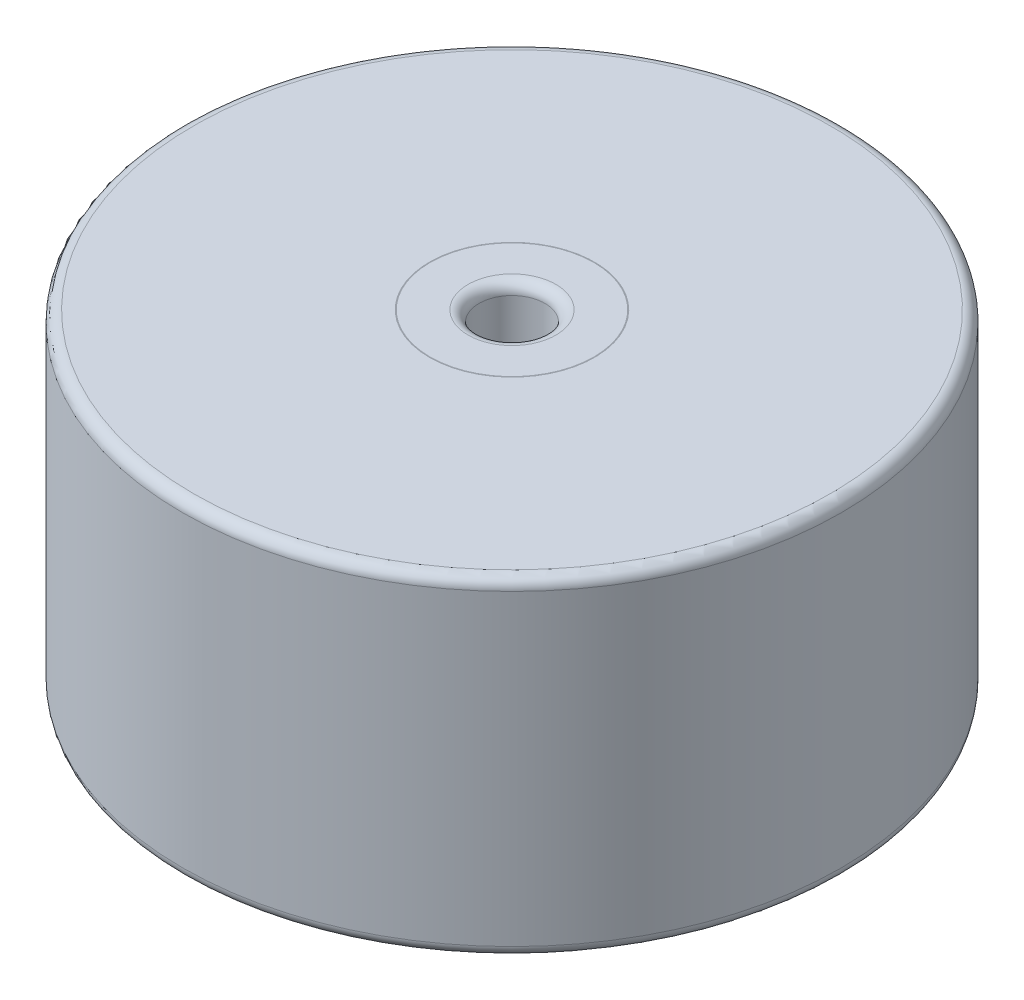
ISO-10303-21;
HEADER;
FILE_DESCRIPTION(('STEP AP214'),'2;1');
FILE_NAME('part.step','',(''),(''),'','','');
FILE_SCHEMA(('AUTOMOTIVE_DESIGN { 1 0 10303 214 1 1 1 1 }'));
ENDSEC;
DATA;
#1=APPLICATION_CONTEXT('core data for automotive mechanical design processes');
#2=APPLICATION_PROTOCOL_DEFINITION('international standard','automotive_design',2000,#1);
#3=PRODUCT_CONTEXT('',#1,'mechanical');
#4=PRODUCT('Part','Part','',(#3));
#5=PRODUCT_RELATED_PRODUCT_CATEGORY('part','',(#4));
#6=PRODUCT_DEFINITION_FORMATION('','',#4);
#7=PRODUCT_DEFINITION_CONTEXT('part definition',#1,'design');
#8=PRODUCT_DEFINITION('design','',#6,#7);
#9=PRODUCT_DEFINITION_SHAPE('','',#8);
#10=(LENGTH_UNIT() NAMED_UNIT(*) SI_UNIT(.MILLI.,.METRE.));
#11=(NAMED_UNIT(*) PLANE_ANGLE_UNIT() SI_UNIT($,.RADIAN.));
#12=(NAMED_UNIT(*) SI_UNIT($,.STERADIAN.) SOLID_ANGLE_UNIT());
#13=UNCERTAINTY_MEASURE_WITH_UNIT(LENGTH_MEASURE(1.E-05),#10,'distance_accuracy_value','');
#14=(GEOMETRIC_REPRESENTATION_CONTEXT(3) GLOBAL_UNCERTAINTY_ASSIGNED_CONTEXT((#13)) GLOBAL_UNIT_ASSIGNED_CONTEXT((#10,
#11,#12)) REPRESENTATION_CONTEXT('',''));
#15=CARTESIAN_POINT('',(0.,0.,0.));
#16=DIRECTION('',(0.,0.,1.));
#17=DIRECTION('',(1.,0.,0.));
#18=AXIS2_PLACEMENT_3D('',#15,#16,#17);
#19=CARTESIAN_POINT('',(0.,300.,0.));
#20=DIRECTION('',(0.,1.,0.));
#21=DIRECTION('',(0.,0.,1.));
#22=AXIS2_PLACEMENT_3D('',#19,#20,#21);
#23=PLANE('',#22);
#24=CARTESIAN_POINT('',(0.,300.,0.));
#25=DIRECTION('',(0.,1.,0.));
#26=DIRECTION('',(0.,0.,1.));
#27=AXIS2_PLACEMENT_3D('',#24,#25,#26);
#28=CIRCLE('',#27,75.1852746920281);
#29=CARTESIAN_POINT('',(0.,300.,75.1852746920281));
#30=VERTEX_POINT('',#29);
#31=EDGE_CURVE('E50',#30,#30,#28,.F.);
#32=ORIENTED_EDGE('',*,*,#31,.T.);
#33=EDGE_LOOP('',(#32));
#34=FACE_BOUND('',#33,.T.);
#35=CARTESIAN_POINT('',(0.,300.,0.));
#36=DIRECTION('',(0.,1.,0.));
#37=DIRECTION('',(0.,0.,1.));
#38=AXIS2_PLACEMENT_3D('',#35,#36,#37);
#39=CIRCLE('',#38,290.);
#40=CARTESIAN_POINT('',(0.,300.,290.));
#41=VERTEX_POINT('',#40);
#42=EDGE_CURVE('E61',#41,#41,#39,.T.);
#43=ORIENTED_EDGE('',*,*,#42,.T.);
#44=EDGE_LOOP('',(#43));
#45=FACE_BOUND('',#44,.T.);
#46=ADVANCED_FACE('F37',(#34,#45),#23,.T.);
#47=CARTESIAN_POINT('',(0.,0.,0.));
#48=DIRECTION('',(0.,1.,0.));
#49=DIRECTION('',(0.,0.,1.));
#50=AXIS2_PLACEMENT_3D('',#47,#48,#49);
#51=PLANE('',#50);
#52=CARTESIAN_POINT('',(0.,0.,0.));
#53=DIRECTION('',(0.,1.,0.));
#54=DIRECTION('',(0.,0.,1.));
#55=AXIS2_PLACEMENT_3D('',#52,#53,#54);
#56=CIRCLE('',#55,40.);
#57=CARTESIAN_POINT('',(0.,0.,40.));
#58=VERTEX_POINT('',#57);
#59=EDGE_CURVE('E45',#58,#58,#56,.T.);
#60=ORIENTED_EDGE('',*,*,#59,.T.);
#61=EDGE_LOOP('',(#60));
#62=FACE_BOUND('',#61,.T.);
#63=CARTESIAN_POINT('',(0.,0.,0.));
#64=DIRECTION('',(0.,1.,0.));
#65=DIRECTION('',(0.,0.,1.));
#66=AXIS2_PLACEMENT_3D('',#63,#64,#65);
#67=CIRCLE('',#66,290.);
#68=CARTESIAN_POINT('',(0.,0.,290.));
#69=VERTEX_POINT('',#68);
#70=EDGE_CURVE('E65',#69,#69,#67,.F.);
#71=ORIENTED_EDGE('',*,*,#70,.T.);
#72=EDGE_LOOP('',(#71));
#73=FACE_BOUND('',#72,.T.);
#74=ADVANCED_FACE('F113',(#62,#73),#51,.F.);
#75=CARTESIAN_POINT('',(0.,300.,0.));
#76=DIRECTION('',(0.,-1.,0.));
#77=DIRECTION('',(0.,0.,-1.));
#78=AXIS2_PLACEMENT_3D('',#75,#76,#77);
#79=CYLINDRICAL_SURFACE('',#78,300.);
#80=CARTESIAN_POINT('',(0.,10.,0.));
#81=DIRECTION('',(0.,1.,0.));
#82=DIRECTION('',(0.,0.,1.));
#83=AXIS2_PLACEMENT_3D('',#80,#81,#82);
#84=CIRCLE('',#83,300.);
#85=CARTESIAN_POINT('',(0.,10.,300.));
#86=VERTEX_POINT('',#85);
#87=EDGE_CURVE('E69',#86,#86,#84,.T.);
#88=ORIENTED_EDGE('',*,*,#87,.T.);
#89=EDGE_LOOP('',(#88));
#90=FACE_BOUND('',#89,.T.);
#91=CARTESIAN_POINT('',(0.,290.,0.));
#92=DIRECTION('',(0.,1.,0.));
#93=DIRECTION('',(0.,0.,1.));
#94=AXIS2_PLACEMENT_3D('',#91,#92,#93);
#95=CIRCLE('',#94,300.);
#96=CARTESIAN_POINT('',(0.,290.,300.));
#97=VERTEX_POINT('',#96);
#98=EDGE_CURVE('E73',#97,#97,#95,.F.);
#99=ORIENTED_EDGE('',*,*,#98,.T.);
#100=EDGE_LOOP('',(#99));
#101=FACE_BOUND('',#100,.T.);
#102=ADVANCED_FACE('F109',(#90,#101),#79,.T.);
#103=CARTESIAN_POINT('',(0.,300.01,0.));
#104=DIRECTION('',(0.,1.,0.));
#105=DIRECTION('',(0.,0.,1.));
#106=AXIS2_PLACEMENT_3D('',#103,#104,#105);
#107=PLANE('',#106);
#108=CARTESIAN_POINT('',(0.,300.01,0.));
#109=DIRECTION('',(0.,1.,0.));
#110=DIRECTION('',(0.,0.,1.));
#111=AXIS2_PLACEMENT_3D('',#108,#109,#110);
#112=CIRCLE('',#111,74.5528982218778);
#113=CARTESIAN_POINT('',(0.,300.01,74.5528982218778));
#114=VERTEX_POINT('',#113);
#115=EDGE_CURVE('E81',#114,#114,#112,.T.);
#116=ORIENTED_EDGE('',*,*,#115,.T.);
#117=EDGE_LOOP('',(#116));
#118=FACE_BOUND('',#117,.T.);
#119=CARTESIAN_POINT('',(0.,300.01,0.));
#120=DIRECTION('',(0.,1.,0.));
#121=DIRECTION('',(0.,0.,1.));
#122=AXIS2_PLACEMENT_3D('',#119,#120,#121);
#123=CIRCLE('',#122,40.);
#124=CARTESIAN_POINT('',(0.,300.01,40.));
#125=VERTEX_POINT('',#124);
#126=EDGE_CURVE('E85',#125,#125,#123,.F.);
#127=ORIENTED_EDGE('',*,*,#126,.T.);
#128=EDGE_LOOP('',(#127));
#129=FACE_BOUND('',#128,.T.);
#130=ADVANCED_FACE('F90',(#118,#129),#107,.T.);
#131=CARTESIAN_POINT('',(0.,0.,0.));
#132=DIRECTION('',(0.,1.,0.));
#133=DIRECTION('',(0.,0.,1.));
#134=AXIS2_PLACEMENT_3D('',#131,#132,#133);
#135=CYLINDRICAL_SURFACE('',#134,30.);
#136=CARTESIAN_POINT('',(0.,10.,0.));
#137=DIRECTION('',(0.,1.,0.));
#138=DIRECTION('',(0.,0.,1.));
#139=AXIS2_PLACEMENT_3D('',#136,#137,#138);
#140=CIRCLE('',#139,30.);
#141=CARTESIAN_POINT('',(0.,10.,30.));
#142=VERTEX_POINT('',#141);
#143=EDGE_CURVE('E10',#142,#142,#140,.F.);
#144=ORIENTED_EDGE('',*,*,#143,.T.);
#145=EDGE_LOOP('',(#144));
#146=FACE_BOUND('',#145,.T.);
#147=CARTESIAN_POINT('',(0.,290.01,0.));
#148=DIRECTION('',(0.,1.,0.));
#149=DIRECTION('',(0.,0.,1.));
#150=AXIS2_PLACEMENT_3D('',#147,#148,#149);
#151=CIRCLE('',#150,30.);
#152=CARTESIAN_POINT('',(0.,290.01,30.));
#153=VERTEX_POINT('',#152);
#154=EDGE_CURVE('E77',#153,#153,#151,.T.);
#155=ORIENTED_EDGE('',*,*,#154,.T.);
#156=EDGE_LOOP('',(#155));
#157=FACE_BOUND('',#156,.T.);
#158=ADVANCED_FACE('F100',(#146,#157),#135,.F.);
#159=CARTESIAN_POINT('',(0.,290.01,0.));
#160=DIRECTION('',(0.,-1.,0.));
#161=DIRECTION('',(0.,0.,-1.));
#162=AXIS2_PLACEMENT_3D('',#159,#160,#161);
#163=TOROIDAL_SURFACE('',#162,74.5528982218778,10.);
#164=CARTESIAN_POINT('',(0.,300.004999999957,0.));
#165=DIRECTION('',(0.,-1.,0.));
#166=DIRECTION('',(0.,0.,-1.));
#167=AXIS2_PLACEMENT_3D('',#164,#165,#166);
#168=CIRCLE('',#167,74.8690864569516);
#169=CARTESIAN_POINT('',(0.,300.004999999957,-74.8690864569516));
#170=VERTEX_POINT('',#169);
#171=EDGE_CURVE('E55',#170,#170,#168,.F.);
#172=ORIENTED_EDGE('',*,*,#171,.T.);
#173=EDGE_LOOP('',(#172));
#174=FACE_BOUND('',#173,.T.);
#175=ORIENTED_EDGE('',*,*,#115,.F.);
#176=EDGE_LOOP('',(#175));
#177=FACE_BOUND('',#176,.T.);
#178=ADVANCED_FACE('F96',(#174,#177),#163,.T.);
#179=CARTESIAN_POINT('',(0.,290.01,0.));
#180=DIRECTION('',(0.,1.,0.));
#181=DIRECTION('',(0.,0.,1.));
#182=AXIS2_PLACEMENT_3D('',#179,#180,#181);
#183=TOROIDAL_SURFACE('',#182,40.,10.);
#184=ORIENTED_EDGE('',*,*,#126,.F.);
#185=EDGE_LOOP('',(#184));
#186=FACE_BOUND('',#185,.T.);
#187=ORIENTED_EDGE('',*,*,#154,.F.);
#188=EDGE_LOOP('',(#187));
#189=FACE_BOUND('',#188,.T.);
#190=ADVANCED_FACE('F92',(#186,#189),#183,.T.);
#191=CARTESIAN_POINT('',(0.,10.,0.));
#192=DIRECTION('',(0.,1.,0.));
#193=DIRECTION('',(0.,0.,1.));
#194=AXIS2_PLACEMENT_3D('',#191,#192,#193);
#195=TOROIDAL_SURFACE('',#194,290.,10.);
#196=ORIENTED_EDGE('',*,*,#70,.F.);
#197=EDGE_LOOP('',(#196));
#198=FACE_BOUND('',#197,.T.);
#199=ORIENTED_EDGE('',*,*,#87,.F.);
#200=EDGE_LOOP('',(#199));
#201=FACE_BOUND('',#200,.T.);
#202=ADVANCED_FACE('F95',(#198,#201),#195,.T.);
#203=CARTESIAN_POINT('',(0.,290.,0.));
#204=DIRECTION('',(0.,1.,0.));
#205=DIRECTION('',(0.,0.,1.));
#206=AXIS2_PLACEMENT_3D('',#203,#204,#205);
#207=TOROIDAL_SURFACE('',#206,290.,10.);
#208=ORIENTED_EDGE('',*,*,#98,.F.);
#209=EDGE_LOOP('',(#208));
#210=FACE_BOUND('',#209,.T.);
#211=ORIENTED_EDGE('',*,*,#42,.F.);
#212=EDGE_LOOP('',(#211));
#213=FACE_BOUND('',#212,.T.);
#214=ADVANCED_FACE('F127',(#210,#213),#207,.T.);
#215=CARTESIAN_POINT('',(0.,310.,0.));
#216=DIRECTION('',(0.,1.,0.));
#217=DIRECTION('',(0.,0.,1.));
#218=AXIS2_PLACEMENT_3D('',#215,#216,#217);
#219=TOROIDAL_SURFACE('',#218,75.1852746920281,10.);
#220=ORIENTED_EDGE('',*,*,#31,.F.);
#221=EDGE_LOOP('',(#220));
#222=FACE_BOUND('',#221,.T.);
#223=ORIENTED_EDGE('',*,*,#171,.F.);
#224=EDGE_LOOP('',(#223));
#225=FACE_BOUND('',#224,.T.);
#226=ADVANCED_FACE('F130',(#222,#225),#219,.F.);
#227=CARTESIAN_POINT('',(0.,10.,0.));
#228=DIRECTION('',(0.,1.,0.));
#229=DIRECTION('',(0.,0.,1.));
#230=AXIS2_PLACEMENT_3D('',#227,#228,#229);
#231=TOROIDAL_SURFACE('',#230,40.,10.);
#232=ORIENTED_EDGE('',*,*,#143,.F.);
#233=EDGE_LOOP('',(#232));
#234=FACE_BOUND('',#233,.T.);
#235=ORIENTED_EDGE('',*,*,#59,.F.);
#236=EDGE_LOOP('',(#235));
#237=FACE_BOUND('',#236,.T.);
#238=ADVANCED_FACE('F39',(#234,#237),#231,.T.);
#239=CLOSED_SHELL('',(#46,#74,#102,#130,#158,#178,#190,#202,#214,#226,#238));
#240=MANIFOLD_SOLID_BREP('B2',#239);
#241=ADVANCED_BREP_SHAPE_REPRESENTATION('',(#18,#240),#14);
#242=SHAPE_DEFINITION_REPRESENTATION(#9,#241);
ENDSEC;
END-ISO-10303-21;
